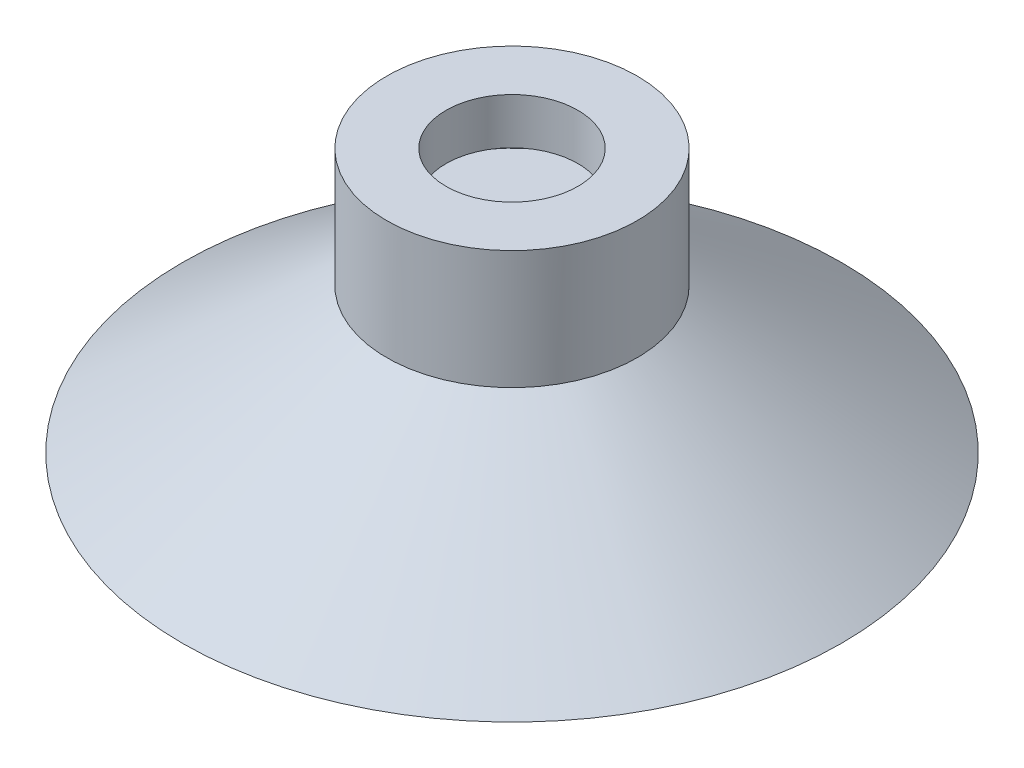
ISO-10303-21;
HEADER;
FILE_DESCRIPTION(('STEP AP214'),'2;1');
FILE_NAME('part.step','',(''),(''),'','','');
FILE_SCHEMA(('AUTOMOTIVE_DESIGN { 1 0 10303 214 1 1 1 1 }'));
ENDSEC;
DATA;
#1=APPLICATION_CONTEXT('core data for automotive mechanical design processes');
#2=APPLICATION_PROTOCOL_DEFINITION('international standard','automotive_design',2000,#1);
#3=PRODUCT_CONTEXT('',#1,'mechanical');
#4=PRODUCT('Part','Part','',(#3));
#5=PRODUCT_RELATED_PRODUCT_CATEGORY('part','',(#4));
#6=PRODUCT_DEFINITION_FORMATION('','',#4);
#7=PRODUCT_DEFINITION_CONTEXT('part definition',#1,'design');
#8=PRODUCT_DEFINITION('design','',#6,#7);
#9=PRODUCT_DEFINITION_SHAPE('','',#8);
#10=(LENGTH_UNIT() NAMED_UNIT(*) SI_UNIT(.MILLI.,.METRE.));
#11=(NAMED_UNIT(*) PLANE_ANGLE_UNIT() SI_UNIT($,.RADIAN.));
#12=(NAMED_UNIT(*) SI_UNIT($,.STERADIAN.) SOLID_ANGLE_UNIT());
#13=UNCERTAINTY_MEASURE_WITH_UNIT(LENGTH_MEASURE(1.E-05),#10,'distance_accuracy_value','');
#14=(GEOMETRIC_REPRESENTATION_CONTEXT(3) GLOBAL_UNCERTAINTY_ASSIGNED_CONTEXT((#13)) GLOBAL_UNIT_ASSIGNED_CONTEXT((#10,
#11,#12)) REPRESENTATION_CONTEXT('',''));
#15=CARTESIAN_POINT('',(0.,0.,0.));
#16=DIRECTION('',(0.,0.,1.));
#17=DIRECTION('',(1.,0.,0.));
#18=AXIS2_PLACEMENT_3D('',#15,#16,#17);
#19=CARTESIAN_POINT('',(0.,9.,0.));
#20=DIRECTION('',(0.,-1.,0.));
#21=DIRECTION('',(0.,0.,-1.));
#22=AXIS2_PLACEMENT_3D('',#19,#20,#21);
#23=CYLINDRICAL_SURFACE('',#22,9.5);
#24=CARTESIAN_POINT('',(0.,9.,0.));
#25=DIRECTION('',(0.,1.,0.));
#26=DIRECTION('',(0.,0.,1.));
#27=AXIS2_PLACEMENT_3D('',#24,#25,#26);
#28=CIRCLE('',#27,9.5);
#29=CARTESIAN_POINT('',(0.,9.,9.5));
#30=VERTEX_POINT('',#29);
#31=EDGE_CURVE('E10',#30,#30,#28,.T.);
#32=ORIENTED_EDGE('',*,*,#31,.F.);
#33=EDGE_LOOP('',(#32));
#34=FACE_BOUND('',#33,.T.);
#35=CARTESIAN_POINT('',(0.,0.,0.));
#36=DIRECTION('',(0.,-1.,0.));
#37=DIRECTION('',(0.,0.,-1.));
#38=AXIS2_PLACEMENT_3D('',#35,#36,#37);
#39=CIRCLE('',#38,9.5);
#40=CARTESIAN_POINT('',(0.,0.,-9.5));
#41=VERTEX_POINT('',#40);
#42=EDGE_CURVE('E61',#41,#41,#39,.T.);
#43=ORIENTED_EDGE('',*,*,#42,.F.);
#44=EDGE_LOOP('',(#43));
#45=FACE_BOUND('',#44,.T.);
#46=ADVANCED_FACE('F37',(#34,#45),#23,.T.);
#47=CARTESIAN_POINT('',(0.,9.,0.));
#48=DIRECTION('',(0.,1.,0.));
#49=DIRECTION('',(0.,0.,1.));
#50=AXIS2_PLACEMENT_3D('',#47,#48,#49);
#51=PLANE('',#50);
#52=CARTESIAN_POINT('',(0.,9.,0.));
#53=DIRECTION('',(0.,1.,0.));
#54=DIRECTION('',(0.,0.,1.));
#55=AXIS2_PLACEMENT_3D('',#52,#53,#54);
#56=CIRCLE('',#55,5.);
#57=CARTESIAN_POINT('',(0.,9.,5.));
#58=VERTEX_POINT('',#57);
#59=EDGE_CURVE('E44',#58,#58,#56,.T.);
#60=ORIENTED_EDGE('',*,*,#59,.F.);
#61=EDGE_LOOP('',(#60));
#62=FACE_BOUND('',#61,.T.);
#63=ORIENTED_EDGE('',*,*,#31,.T.);
#64=EDGE_LOOP('',(#63));
#65=FACE_BOUND('',#64,.T.);
#66=ADVANCED_FACE('F96',(#62,#65),#51,.T.);
#67=CARTESIAN_POINT('',(0.,5.5,0.));
#68=DIRECTION('',(0.,1.,0.));
#69=DIRECTION('',(0.,0.,1.));
#70=AXIS2_PLACEMENT_3D('',#67,#68,#69);
#71=CYLINDRICAL_SURFACE('',#70,5.);
#72=CARTESIAN_POINT('',(0.,5.5,0.));
#73=DIRECTION('',(0.,1.,0.));
#74=DIRECTION('',(0.,0.,1.));
#75=AXIS2_PLACEMENT_3D('',#72,#73,#74);
#76=CIRCLE('',#75,5.);
#77=CARTESIAN_POINT('',(0.,5.5,5.));
#78=VERTEX_POINT('',#77);
#79=EDGE_CURVE('E49',#78,#78,#76,.T.);
#80=ORIENTED_EDGE('',*,*,#79,.F.);
#81=EDGE_LOOP('',(#80));
#82=FACE_BOUND('',#81,.T.);
#83=ORIENTED_EDGE('',*,*,#59,.T.);
#84=EDGE_LOOP('',(#83));
#85=FACE_BOUND('',#84,.T.);
#86=ADVANCED_FACE('F101',(#82,#85),#71,.F.);
#87=CARTESIAN_POINT('',(0.,3.,0.));
#88=DIRECTION('',(0.,1.,0.));
#89=DIRECTION('',(0.,0.,1.));
#90=AXIS2_PLACEMENT_3D('',#87,#88,#89);
#91=CYLINDRICAL_SURFACE('',#90,8.5);
#92=CARTESIAN_POINT('',(0.,3.,0.));
#93=DIRECTION('',(0.,1.,0.));
#94=DIRECTION('',(0.,0.,1.));
#95=AXIS2_PLACEMENT_3D('',#92,#93,#94);
#96=CIRCLE('',#95,8.5);
#97=CARTESIAN_POINT('',(0.,3.,8.5));
#98=VERTEX_POINT('',#97);
#99=EDGE_CURVE('E54',#98,#98,#96,.T.);
#100=ORIENTED_EDGE('',*,*,#99,.F.);
#101=EDGE_LOOP('',(#100));
#102=FACE_BOUND('',#101,.T.);
#103=CARTESIAN_POINT('',(0.,5.5,0.));
#104=DIRECTION('',(0.,1.,0.));
#105=DIRECTION('',(0.,0.,1.));
#106=AXIS2_PLACEMENT_3D('',#103,#104,#105);
#107=CIRCLE('',#106,8.5);
#108=CARTESIAN_POINT('',(0.,5.5,8.5));
#109=VERTEX_POINT('',#108);
#110=EDGE_CURVE('E57',#109,#109,#107,.T.);
#111=ORIENTED_EDGE('',*,*,#110,.T.);
#112=EDGE_LOOP('',(#111));
#113=FACE_BOUND('',#112,.T.);
#114=ADVANCED_FACE('F122',(#102,#113),#91,.F.);
#115=CARTESIAN_POINT('',(0.,3.,0.));
#116=DIRECTION('',(0.,1.,0.));
#117=DIRECTION('',(0.,0.,1.));
#118=AXIS2_PLACEMENT_3D('',#115,#116,#117);
#119=PLANE('',#118);
#120=ORIENTED_EDGE('',*,*,#99,.T.);
#121=EDGE_LOOP('',(#120));
#122=FACE_BOUND('',#121,.T.);
#123=ADVANCED_FACE('F117',(#122),#119,.T.);
#124=CARTESIAN_POINT('',(0.,5.5,0.));
#125=DIRECTION('',(0.,1.,0.));
#126=DIRECTION('',(0.,0.,1.));
#127=AXIS2_PLACEMENT_3D('',#124,#125,#126);
#128=PLANE('',#127);
#129=ORIENTED_EDGE('',*,*,#79,.T.);
#130=EDGE_LOOP('',(#129));
#131=FACE_BOUND('',#130,.T.);
#132=ORIENTED_EDGE('',*,*,#110,.F.);
#133=EDGE_LOOP('',(#132));
#134=FACE_BOUND('',#133,.T.);
#135=ADVANCED_FACE('F109',(#131,#134),#128,.F.);
#136=CARTESIAN_POINT('',(0.,-11.,0.));
#137=DIRECTION('',(0.,-1.,0.));
#138=DIRECTION('',(0.,0.,-1.));
#139=AXIS2_PLACEMENT_3D('',#136,#137,#138);
#140=CONICAL_SURFACE('',#139,25.,0.953604935254535);
#141=ORIENTED_EDGE('',*,*,#42,.T.);
#142=EDGE_LOOP('',(#141));
#143=FACE_BOUND('',#142,.T.);
#144=CARTESIAN_POINT('',(0.,-11.,0.));
#145=DIRECTION('',(0.,-1.,0.));
#146=DIRECTION('',(0.,0.,-1.));
#147=AXIS2_PLACEMENT_3D('',#144,#145,#146);
#148=CIRCLE('',#147,25.);
#149=CARTESIAN_POINT('',(0.,-11.,-25.));
#150=VERTEX_POINT('',#149);
#151=EDGE_CURVE('E68',#150,#150,#148,.T.);
#152=ORIENTED_EDGE('',*,*,#151,.F.);
#153=EDGE_LOOP('',(#152));
#154=FACE_BOUND('',#153,.T.);
#155=ADVANCED_FACE('F92',(#143,#154),#140,.T.);
#156=CARTESIAN_POINT('',(25.,-11.,0.));
#157=DIRECTION('',(0.,-1.,0.));
#158=DIRECTION('',(0.,0.,-1.));
#159=AXIS2_PLACEMENT_3D('',#156,#157,#158);
#160=PLANE('',#159);
#161=ORIENTED_EDGE('',*,*,#151,.T.);
#162=EDGE_LOOP('',(#161));
#163=FACE_BOUND('',#162,.T.);
#164=CARTESIAN_POINT('',(0.,-11.,0.));
#165=DIRECTION('',(0.,-1.,0.));
#166=DIRECTION('',(0.,0.,-1.));
#167=AXIS2_PLACEMENT_3D('',#164,#165,#166);
#168=CIRCLE('',#167,21.5442585802276);
#169=CARTESIAN_POINT('',(0.,-11.,-21.5442585802276));
#170=VERTEX_POINT('',#169);
#171=EDGE_CURVE('E72',#170,#170,#168,.T.);
#172=ORIENTED_EDGE('',*,*,#171,.F.);
#173=EDGE_LOOP('',(#172));
#174=FACE_BOUND('',#173,.T.);
#175=ADVANCED_FACE('F85',(#163,#174),#160,.T.);
#176=CARTESIAN_POINT('',(0.,0.,0.));
#177=DIRECTION('',(0.,-1.,0.));
#178=DIRECTION('',(0.,0.,-1.));
#179=AXIS2_PLACEMENT_3D('',#176,#177,#178);
#180=CONICAL_SURFACE('',#179,6.04425858022759,0.953604935254535);
#181=ORIENTED_EDGE('',*,*,#171,.T.);
#182=EDGE_LOOP('',(#181));
#183=FACE_BOUND('',#182,.T.);
#184=CARTESIAN_POINT('',(0.,0.,0.));
#185=DIRECTION('',(0.,-1.,0.));
#186=DIRECTION('',(0.,0.,-1.));
#187=AXIS2_PLACEMENT_3D('',#184,#185,#186);
#188=CIRCLE('',#187,6.04425858022759);
#189=CARTESIAN_POINT('',(0.,0.,-6.04425858022759));
#190=VERTEX_POINT('',#189);
#191=EDGE_CURVE('E76',#190,#190,#188,.T.);
#192=ORIENTED_EDGE('',*,*,#191,.F.);
#193=EDGE_LOOP('',(#192));
#194=FACE_BOUND('',#193,.T.);
#195=ADVANCED_FACE('F83',(#183,#194),#180,.F.);
#196=CARTESIAN_POINT('',(0.,0.,0.));
#197=DIRECTION('',(0.,1.,0.));
#198=DIRECTION('',(0.,0.,1.));
#199=AXIS2_PLACEMENT_3D('',#196,#197,#198);
#200=PLANE('',#199);
#201=ORIENTED_EDGE('',*,*,#191,.T.);
#202=EDGE_LOOP('',(#201));
#203=FACE_BOUND('',#202,.T.);
#204=ADVANCED_FACE('F81',(#203),#200,.F.);
#205=CLOSED_SHELL('',(#46,#66,#86,#114,#123,#135,#155,#175,#195,#204));
#206=MANIFOLD_SOLID_BREP('B2',#205);
#207=ADVANCED_BREP_SHAPE_REPRESENTATION('',(#18,#206),#14);
#208=SHAPE_DEFINITION_REPRESENTATION(#9,#207);
ENDSEC;
END-ISO-10303-21;
